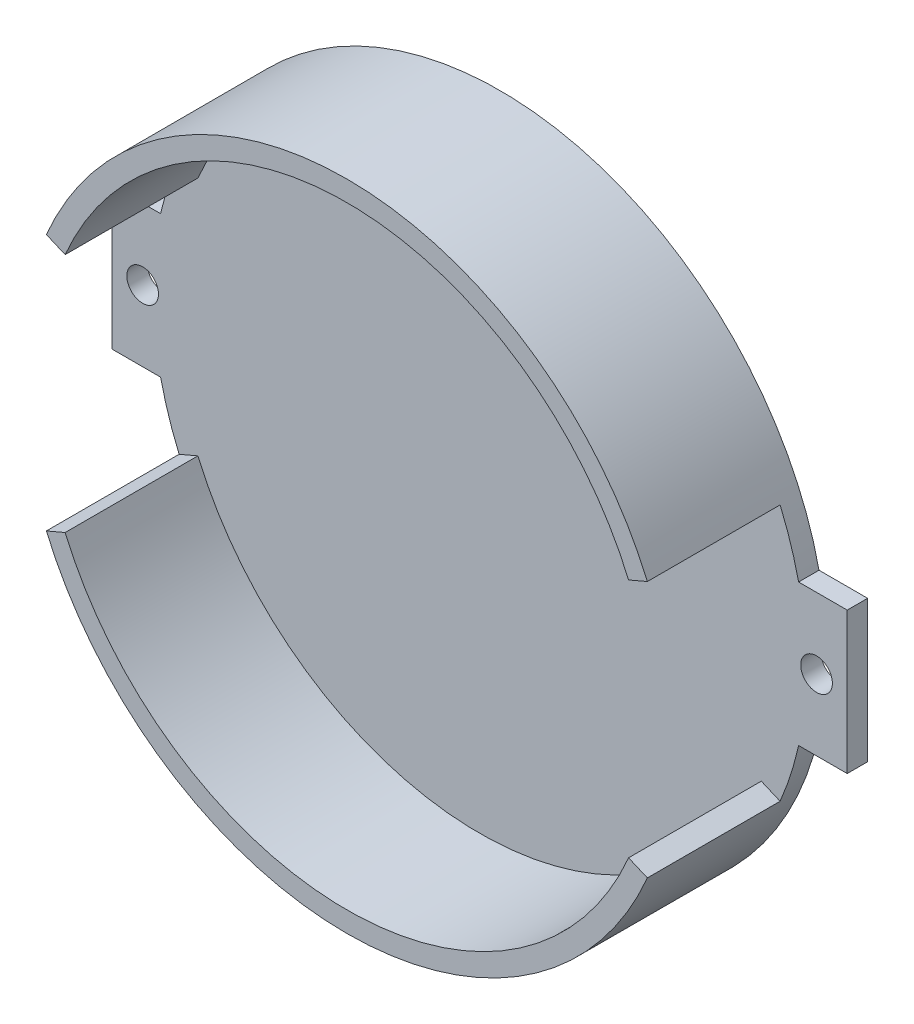
ISO-10303-21;
HEADER;
FILE_DESCRIPTION(('STEP AP214'),'2;1');
FILE_NAME('part.step','',(''),(''),'','','');
FILE_SCHEMA(('AUTOMOTIVE_DESIGN { 1 0 10303 214 1 1 1 1 }'));
ENDSEC;
DATA;
#1=APPLICATION_CONTEXT('core data for automotive mechanical design processes');
#2=APPLICATION_PROTOCOL_DEFINITION('international standard','automotive_design',2000,#1);
#3=PRODUCT_CONTEXT('',#1,'mechanical');
#4=PRODUCT('Part','Part','',(#3));
#5=PRODUCT_RELATED_PRODUCT_CATEGORY('part','',(#4));
#6=PRODUCT_DEFINITION_FORMATION('','',#4);
#7=PRODUCT_DEFINITION_CONTEXT('part definition',#1,'design');
#8=PRODUCT_DEFINITION('design','',#6,#7);
#9=PRODUCT_DEFINITION_SHAPE('','',#8);
#10=(LENGTH_UNIT() NAMED_UNIT(*) SI_UNIT(.MILLI.,.METRE.));
#11=(NAMED_UNIT(*) PLANE_ANGLE_UNIT() SI_UNIT($,.RADIAN.));
#12=(NAMED_UNIT(*) SI_UNIT($,.STERADIAN.) SOLID_ANGLE_UNIT());
#13=UNCERTAINTY_MEASURE_WITH_UNIT(LENGTH_MEASURE(1.E-05),#10,'distance_accuracy_value','');
#14=(GEOMETRIC_REPRESENTATION_CONTEXT(3) GLOBAL_UNCERTAINTY_ASSIGNED_CONTEXT((#13)) GLOBAL_UNIT_ASSIGNED_CONTEXT((#10,
#11,#12)) REPRESENTATION_CONTEXT('',''));
#15=CARTESIAN_POINT('',(0.,0.,0.));
#16=DIRECTION('',(0.,0.,1.));
#17=DIRECTION('',(1.,0.,0.));
#18=AXIS2_PLACEMENT_3D('',#15,#16,#17);
#19=CARTESIAN_POINT('',(0.,0.,2.));
#20=DIRECTION('',(0.,0.,1.));
#21=DIRECTION('',(1.,0.,0.));
#22=AXIS2_PLACEMENT_3D('',#19,#20,#21);
#23=PLANE('',#22);
#24=CARTESIAN_POINT('',(33.,0.,2.));
#25=DIRECTION('',(0.,0.,1.));
#26=DIRECTION('',(1.,0.,0.));
#27=AXIS2_PLACEMENT_3D('',#24,#25,#26);
#28=CIRCLE('',#27,1.55);
#29=CARTESIAN_POINT('',(34.55,0.,2.));
#30=VERTEX_POINT('',#29);
#31=EDGE_CURVE('E349',#30,#30,#28,.T.);
#32=ORIENTED_EDGE('',*,*,#31,.F.);
#33=EDGE_LOOP('',(#32));
#34=FACE_BOUND('',#33,.T.);
#35=CARTESIAN_POINT('',(-33.,0.,2.));
#36=DIRECTION('',(0.,0.,1.));
#37=DIRECTION('',(1.,0.,0.));
#38=AXIS2_PLACEMENT_3D('',#35,#36,#37);
#39=CIRCLE('',#38,1.55);
#40=CARTESIAN_POINT('',(-31.45,0.,2.));
#41=VERTEX_POINT('',#40);
#42=EDGE_CURVE('E356',#41,#41,#39,.T.);
#43=ORIENTED_EDGE('',*,*,#42,.F.);
#44=EDGE_LOOP('',(#43));
#45=FACE_BOUND('',#44,.T.);
#46=CARTESIAN_POINT('',(0.,0.,2.));
#47=DIRECTION('',(0.,0.,-1.));
#48=DIRECTION('',(1.,0.,0.));
#49=AXIS2_PLACEMENT_3D('',#46,#47,#48);
#50=CIRCLE('',#49,30.);
#51=CARTESIAN_POINT('',(27.5892817920815,-11.7826792452787,2.));
#52=VERTEX_POINT('',#51);
#53=CARTESIAN_POINT('',(-27.5892817920815,-11.7826792452786,2.));
#54=VERTEX_POINT('',#53);
#55=EDGE_CURVE('E345',#52,#54,#50,.T.);
#56=ORIENTED_EDGE('',*,*,#55,.F.);
#57=DIRECTION('',(-0.919642726402717,0.39275597484262,0.));
#58=VECTOR('',#57,1.);
#59=CARTESIAN_POINT('',(27.5892817920815,-11.7826792452787,2.));
#60=LINE('',#59,#58);
#61=CARTESIAN_POINT('',(29.4285672448869,-12.5681911949639,2.));
#62=VERTEX_POINT('',#61);
#63=EDGE_CURVE('E322',#62,#52,#60,.T.);
#64=ORIENTED_EDGE('',*,*,#63,.F.);
#65=CARTESIAN_POINT('',(0.,0.,2.));
#66=DIRECTION('',(0.,0.,1.));
#67=DIRECTION('',(1.,0.,0.));
#68=AXIS2_PLACEMENT_3D('',#65,#66,#67);
#69=CIRCLE('',#68,32.);
#70=CARTESIAN_POINT('',(31.2398605772959,-6.93333333333333,2.));
#71=VERTEX_POINT('',#70);
#72=EDGE_CURVE('E179',#62,#71,#69,.T.);
#73=ORIENTED_EDGE('',*,*,#72,.T.);
#74=DIRECTION('',(1.,0.,0.));
#75=VECTOR('',#74,1.);
#76=CARTESIAN_POINT('',(31.2398605772959,-6.93333333333333,2.));
#77=LINE('',#76,#75);
#78=CARTESIAN_POINT('',(36.,-6.93333333333333,2.));
#79=VERTEX_POINT('',#78);
#80=EDGE_CURVE('E240',#71,#79,#77,.T.);
#81=ORIENTED_EDGE('',*,*,#80,.T.);
#82=DIRECTION('',(0.,1.,0.));
#83=VECTOR('',#82,1.);
#84=CARTESIAN_POINT('',(36.,-6.93333333333333,2.));
#85=LINE('',#84,#83);
#86=CARTESIAN_POINT('',(36.,6.93333333333334,2.));
#87=VERTEX_POINT('',#86);
#88=EDGE_CURVE('E243',#79,#87,#85,.T.);
#89=ORIENTED_EDGE('',*,*,#88,.T.);
#90=DIRECTION('',(-1.,0.,0.));
#91=VECTOR('',#90,1.);
#92=CARTESIAN_POINT('',(36.,6.93333333333334,2.));
#93=LINE('',#92,#91);
#94=CARTESIAN_POINT('',(31.2398605772959,6.93333333333333,2.));
#95=VERTEX_POINT('',#94);
#96=EDGE_CURVE('E246',#87,#95,#93,.T.);
#97=ORIENTED_EDGE('',*,*,#96,.T.);
#98=CARTESIAN_POINT('',(0.,0.,2.));
#99=DIRECTION('',(0.,0.,1.));
#100=DIRECTION('',(1.,0.,0.));
#101=AXIS2_PLACEMENT_3D('',#98,#99,#100);
#102=CIRCLE('',#101,32.);
#103=CARTESIAN_POINT('',(29.4285672448869,12.5681911949639,2.));
#104=VERTEX_POINT('',#103);
#105=EDGE_CURVE('E250',#95,#104,#102,.T.);
#106=ORIENTED_EDGE('',*,*,#105,.T.);
#107=DIRECTION('',(0.919642726402717,0.392755974842622,0.));
#108=VECTOR('',#107,1.);
#109=CARTESIAN_POINT('',(29.4285672448869,12.5681911949639,2.));
#110=LINE('',#109,#108);
#111=CARTESIAN_POINT('',(27.5892817920815,11.7826792452787,2.));
#112=VERTEX_POINT('',#111);
#113=EDGE_CURVE('E63',#112,#104,#110,.T.);
#114=ORIENTED_EDGE('',*,*,#113,.F.);
#115=CARTESIAN_POINT('',(0.,0.,2.));
#116=DIRECTION('',(0.,0.,-1.));
#117=DIRECTION('',(1.,0.,0.));
#118=AXIS2_PLACEMENT_3D('',#115,#116,#117);
#119=CIRCLE('',#118,30.);
#120=CARTESIAN_POINT('',(-27.5892817920815,11.7826792452787,2.));
#121=VERTEX_POINT('',#120);
#122=EDGE_CURVE('E186',#121,#112,#119,.T.);
#123=ORIENTED_EDGE('',*,*,#122,.F.);
#124=DIRECTION('',(0.919642726402717,-0.392755974842622,0.));
#125=VECTOR('',#124,1.);
#126=CARTESIAN_POINT('',(-29.4285672448869,12.5681911949639,2.));
#127=LINE('',#126,#125);
#128=CARTESIAN_POINT('',(-29.4285672448869,12.5681911949639,2.));
#129=VERTEX_POINT('',#128);
#130=EDGE_CURVE('E181',#129,#121,#127,.T.);
#131=ORIENTED_EDGE('',*,*,#130,.F.);
#132=CARTESIAN_POINT('',(-31.2398605772959,6.93333333333333,2.));
#133=VERTEX_POINT('',#132);
#134=EDGE_CURVE('E249',#129,#133,#102,.T.);
#135=ORIENTED_EDGE('',*,*,#134,.T.);
#136=DIRECTION('',(-1.,0.,0.));
#137=VECTOR('',#136,1.);
#138=CARTESIAN_POINT('',(-36.,6.93333333333333,2.));
#139=LINE('',#138,#137);
#140=CARTESIAN_POINT('',(-36.,6.93333333333333,2.));
#141=VERTEX_POINT('',#140);
#142=EDGE_CURVE('E225',#133,#141,#139,.T.);
#143=ORIENTED_EDGE('',*,*,#142,.T.);
#144=DIRECTION('',(0.,-1.,0.));
#145=VECTOR('',#144,1.);
#146=CARTESIAN_POINT('',(-36.,-6.93333333333333,2.));
#147=LINE('',#146,#145);
#148=CARTESIAN_POINT('',(-36.,-6.93333333333333,2.));
#149=VERTEX_POINT('',#148);
#150=EDGE_CURVE('E229',#141,#149,#147,.T.);
#151=ORIENTED_EDGE('',*,*,#150,.T.);
#152=DIRECTION('',(1.,0.,0.));
#153=VECTOR('',#152,1.);
#154=CARTESIAN_POINT('',(-31.2398605772959,-6.93333333333333,2.));
#155=LINE('',#154,#153);
#156=CARTESIAN_POINT('',(-31.2398605772959,-6.93333333333333,2.));
#157=VERTEX_POINT('',#156);
#158=EDGE_CURVE('E233',#149,#157,#155,.T.);
#159=ORIENTED_EDGE('',*,*,#158,.T.);
#160=CARTESIAN_POINT('',(-29.4285672448869,-12.5681911949639,2.));
#161=VERTEX_POINT('',#160);
#162=EDGE_CURVE('E236',#157,#161,#69,.T.);
#163=ORIENTED_EDGE('',*,*,#162,.T.);
#164=DIRECTION('',(-0.919642726402717,-0.39275597484262,0.));
#165=VECTOR('',#164,1.);
#166=CARTESIAN_POINT('',(-27.5892817920815,-11.7826792452787,2.));
#167=LINE('',#166,#165);
#168=EDGE_CURVE('E174',#54,#161,#167,.T.);
#169=ORIENTED_EDGE('',*,*,#168,.F.);
#170=EDGE_LOOP('',(#56,#64,#73,#81,#89,#97,#106,#114,#123,#131,#135,#143,#151,#159,#163,#169));
#171=FACE_BOUND('',#170,.T.);
#172=ADVANCED_FACE('F39',(#34,#45,#171),#23,.T.);
#173=CARTESIAN_POINT('',(-36.,6.93333333333333,2.));
#174=DIRECTION('',(0.,-1.,0.));
#175=DIRECTION('',(0.,0.,-1.));
#176=AXIS2_PLACEMENT_3D('',#173,#174,#175);
#177=PLANE('',#176);
#178=DIRECTION('',(-1.,0.,0.));
#179=VECTOR('',#178,1.);
#180=CARTESIAN_POINT('',(-36.,6.93333333333333,0.));
#181=LINE('',#180,#179);
#182=CARTESIAN_POINT('',(-31.2398605772959,6.93333333333333,0.));
#183=VERTEX_POINT('',#182);
#184=CARTESIAN_POINT('',(-36.,6.93333333333333,0.));
#185=VERTEX_POINT('',#184);
#186=EDGE_CURVE('E224',#183,#185,#181,.T.);
#187=ORIENTED_EDGE('',*,*,#186,.T.);
#188=DIRECTION('',(0.,0.,-1.));
#189=VECTOR('',#188,1.);
#190=CARTESIAN_POINT('',(-36.,6.93333333333333,2.));
#191=LINE('',#190,#189);
#192=EDGE_CURVE('E11',#141,#185,#191,.T.);
#193=ORIENTED_EDGE('',*,*,#192,.F.);
#194=ORIENTED_EDGE('',*,*,#142,.F.);
#195=DIRECTION('',(0.,0.,-1.));
#196=VECTOR('',#195,1.);
#197=CARTESIAN_POINT('',(-31.2398605772959,6.93333333333333,2.));
#198=LINE('',#197,#196);
#199=EDGE_CURVE('E253',#133,#183,#198,.T.);
#200=ORIENTED_EDGE('',*,*,#199,.T.);
#201=EDGE_LOOP('',(#187,#193,#194,#200));
#202=FACE_BOUND('',#201,.T.);
#203=ADVANCED_FACE('F41',(#202),#177,.F.);
#204=CARTESIAN_POINT('',(-36.,-6.93333333333333,2.));
#205=DIRECTION('',(1.,0.,0.));
#206=DIRECTION('',(0.,0.,-1.));
#207=AXIS2_PLACEMENT_3D('',#204,#205,#206);
#208=PLANE('',#207);
#209=DIRECTION('',(0.,-1.,0.));
#210=VECTOR('',#209,1.);
#211=CARTESIAN_POINT('',(-36.,-6.93333333333333,0.));
#212=LINE('',#211,#210);
#213=CARTESIAN_POINT('',(-36.,-6.93333333333333,0.));
#214=VERTEX_POINT('',#213);
#215=EDGE_CURVE('E257',#185,#214,#212,.T.);
#216=ORIENTED_EDGE('',*,*,#215,.T.);
#217=DIRECTION('',(0.,0.,-1.));
#218=VECTOR('',#217,1.);
#219=CARTESIAN_POINT('',(-36.,-6.93333333333333,2.));
#220=LINE('',#219,#218);
#221=EDGE_CURVE('E48',#149,#214,#220,.T.);
#222=ORIENTED_EDGE('',*,*,#221,.F.);
#223=ORIENTED_EDGE('',*,*,#150,.F.);
#224=ORIENTED_EDGE('',*,*,#192,.T.);
#225=EDGE_LOOP('',(#216,#222,#223,#224));
#226=FACE_BOUND('',#225,.T.);
#227=ADVANCED_FACE('F334',(#226),#208,.F.);
#228=CARTESIAN_POINT('',(-31.2398605772959,-6.93333333333333,2.));
#229=DIRECTION('',(0.,1.,0.));
#230=DIRECTION('',(-1.,0.,0.));
#231=AXIS2_PLACEMENT_3D('',#228,#229,#230);
#232=PLANE('',#231);
#233=DIRECTION('',(1.,0.,0.));
#234=VECTOR('',#233,1.);
#235=CARTESIAN_POINT('',(-31.2398605772959,-6.93333333333333,0.));
#236=LINE('',#235,#234);
#237=CARTESIAN_POINT('',(-31.2398605772959,-6.93333333333333,0.));
#238=VERTEX_POINT('',#237);
#239=EDGE_CURVE('E260',#214,#238,#236,.T.);
#240=ORIENTED_EDGE('',*,*,#239,.T.);
#241=DIRECTION('',(0.,0.,-1.));
#242=VECTOR('',#241,1.);
#243=CARTESIAN_POINT('',(-31.2398605772959,-6.93333333333333,2.));
#244=LINE('',#243,#242);
#245=EDGE_CURVE('E296',#157,#238,#244,.T.);
#246=ORIENTED_EDGE('',*,*,#245,.F.);
#247=ORIENTED_EDGE('',*,*,#158,.F.);
#248=ORIENTED_EDGE('',*,*,#221,.T.);
#249=EDGE_LOOP('',(#240,#246,#247,#248));
#250=FACE_BOUND('',#249,.T.);
#251=ADVANCED_FACE('F305',(#250),#232,.F.);
#252=CARTESIAN_POINT('',(0.,0.,2.));
#253=DIRECTION('',(0.,0.,-1.));
#254=DIRECTION('',(-1.,0.,0.));
#255=AXIS2_PLACEMENT_3D('',#252,#253,#254);
#256=CYLINDRICAL_SURFACE('',#255,32.);
#257=CARTESIAN_POINT('',(0.,0.,0.));
#258=DIRECTION('',(0.,0.,1.));
#259=DIRECTION('',(1.,0.,0.));
#260=AXIS2_PLACEMENT_3D('',#257,#258,#259);
#261=CIRCLE('',#260,32.);
#262=CARTESIAN_POINT('',(31.2398605772959,-6.93333333333333,0.));
#263=VERTEX_POINT('',#262);
#264=EDGE_CURVE('E263',#238,#263,#261,.T.);
#265=ORIENTED_EDGE('',*,*,#264,.T.);
#266=DIRECTION('',(0.,0.,-1.));
#267=VECTOR('',#266,1.);
#268=CARTESIAN_POINT('',(31.2398605772959,-6.93333333333333,2.));
#269=LINE('',#268,#267);
#270=EDGE_CURVE('E292',#71,#263,#269,.T.);
#271=ORIENTED_EDGE('',*,*,#270,.F.);
#272=ORIENTED_EDGE('',*,*,#72,.F.);
#273=DIRECTION('',(0.,0.,-1.));
#274=VECTOR('',#273,1.);
#275=CARTESIAN_POINT('',(29.4285672448869,-12.5681911949639,15.));
#276=LINE('',#275,#274);
#277=CARTESIAN_POINT('',(29.4285672448869,-12.5681911949639,15.));
#278=VERTEX_POINT('',#277);
#279=EDGE_CURVE('E157',#278,#62,#276,.T.);
#280=ORIENTED_EDGE('',*,*,#279,.F.);
#281=CARTESIAN_POINT('',(0.,0.,15.));
#282=DIRECTION('',(0.,0.,1.));
#283=DIRECTION('',(1.,0.,0.));
#284=AXIS2_PLACEMENT_3D('',#281,#282,#283);
#285=CIRCLE('',#284,32.);
#286=CARTESIAN_POINT('',(-29.4285672448869,-12.5681911949639,15.));
#287=VERTEX_POINT('',#286);
#288=EDGE_CURVE('E165',#287,#278,#285,.T.);
#289=ORIENTED_EDGE('',*,*,#288,.F.);
#290=DIRECTION('',(0.,0.,-1.));
#291=VECTOR('',#290,1.);
#292=CARTESIAN_POINT('',(-29.4285672448869,-12.5681911949639,15.));
#293=LINE('',#292,#291);
#294=EDGE_CURVE('E336',#287,#161,#293,.T.);
#295=ORIENTED_EDGE('',*,*,#294,.T.);
#296=ORIENTED_EDGE('',*,*,#162,.F.);
#297=ORIENTED_EDGE('',*,*,#245,.T.);
#298=EDGE_LOOP('',(#265,#271,#272,#280,#289,#295,#296,#297));
#299=FACE_BOUND('',#298,.T.);
#300=ADVANCED_FACE('F177',(#299),#256,.T.);
#301=CARTESIAN_POINT('',(31.2398605772959,-6.93333333333333,2.));
#302=DIRECTION('',(0.,1.,0.));
#303=DIRECTION('',(-1.,0.,0.));
#304=AXIS2_PLACEMENT_3D('',#301,#302,#303);
#305=PLANE('',#304);
#306=DIRECTION('',(1.,0.,0.));
#307=VECTOR('',#306,1.);
#308=CARTESIAN_POINT('',(31.2398605772959,-6.93333333333333,0.));
#309=LINE('',#308,#307);
#310=CARTESIAN_POINT('',(36.,-6.93333333333333,0.));
#311=VERTEX_POINT('',#310);
#312=EDGE_CURVE('E266',#263,#311,#309,.T.);
#313=ORIENTED_EDGE('',*,*,#312,.T.);
#314=DIRECTION('',(0.,0.,-1.));
#315=VECTOR('',#314,1.);
#316=CARTESIAN_POINT('',(36.,-6.93333333333333,2.));
#317=LINE('',#316,#315);
#318=EDGE_CURVE('E288',#79,#311,#317,.T.);
#319=ORIENTED_EDGE('',*,*,#318,.F.);
#320=ORIENTED_EDGE('',*,*,#80,.F.);
#321=ORIENTED_EDGE('',*,*,#270,.T.);
#322=EDGE_LOOP('',(#313,#319,#320,#321));
#323=FACE_BOUND('',#322,.T.);
#324=ADVANCED_FACE('F317',(#323),#305,.F.);
#325=CARTESIAN_POINT('',(36.,-6.93333333333333,2.));
#326=DIRECTION('',(-1.,0.,0.));
#327=DIRECTION('',(0.,-1.,0.));
#328=AXIS2_PLACEMENT_3D('',#325,#326,#327);
#329=PLANE('',#328);
#330=DIRECTION('',(0.,1.,0.));
#331=VECTOR('',#330,1.);
#332=CARTESIAN_POINT('',(36.,-6.93333333333333,0.));
#333=LINE('',#332,#331);
#334=CARTESIAN_POINT('',(36.,6.93333333333334,0.));
#335=VERTEX_POINT('',#334);
#336=EDGE_CURVE('E269',#311,#335,#333,.T.);
#337=ORIENTED_EDGE('',*,*,#336,.T.);
#338=DIRECTION('',(0.,0.,-1.));
#339=VECTOR('',#338,1.);
#340=CARTESIAN_POINT('',(36.,6.93333333333334,2.));
#341=LINE('',#340,#339);
#342=EDGE_CURVE('E284',#87,#335,#341,.T.);
#343=ORIENTED_EDGE('',*,*,#342,.F.);
#344=ORIENTED_EDGE('',*,*,#88,.F.);
#345=ORIENTED_EDGE('',*,*,#318,.T.);
#346=EDGE_LOOP('',(#337,#343,#344,#345));
#347=FACE_BOUND('',#346,.T.);
#348=ADVANCED_FACE('F405',(#347),#329,.F.);
#349=CARTESIAN_POINT('',(36.,6.93333333333334,2.));
#350=DIRECTION('',(0.,-1.,0.));
#351=DIRECTION('',(1.,0.,0.));
#352=AXIS2_PLACEMENT_3D('',#349,#350,#351);
#353=PLANE('',#352);
#354=DIRECTION('',(-1.,0.,0.));
#355=VECTOR('',#354,1.);
#356=CARTESIAN_POINT('',(36.,6.93333333333334,0.));
#357=LINE('',#356,#355);
#358=CARTESIAN_POINT('',(31.2398605772959,6.93333333333333,0.));
#359=VERTEX_POINT('',#358);
#360=EDGE_CURVE('E272',#335,#359,#357,.T.);
#361=ORIENTED_EDGE('',*,*,#360,.T.);
#362=DIRECTION('',(0.,0.,-1.));
#363=VECTOR('',#362,1.);
#364=CARTESIAN_POINT('',(31.2398605772959,6.93333333333333,2.));
#365=LINE('',#364,#363);
#366=EDGE_CURVE('E280',#95,#359,#365,.T.);
#367=ORIENTED_EDGE('',*,*,#366,.F.);
#368=ORIENTED_EDGE('',*,*,#96,.F.);
#369=ORIENTED_EDGE('',*,*,#342,.T.);
#370=EDGE_LOOP('',(#361,#367,#368,#369));
#371=FACE_BOUND('',#370,.T.);
#372=ADVANCED_FACE('F402',(#371),#353,.F.);
#373=CARTESIAN_POINT('',(0.,0.,2.));
#374=DIRECTION('',(0.,0.,-1.));
#375=DIRECTION('',(-1.,0.,0.));
#376=AXIS2_PLACEMENT_3D('',#373,#374,#375);
#377=CYLINDRICAL_SURFACE('',#376,32.);
#378=CARTESIAN_POINT('',(0.,0.,0.));
#379=DIRECTION('',(0.,0.,1.));
#380=DIRECTION('',(1.,0.,0.));
#381=AXIS2_PLACEMENT_3D('',#378,#379,#380);
#382=CIRCLE('',#381,32.);
#383=EDGE_CURVE('E230',#359,#183,#382,.T.);
#384=ORIENTED_EDGE('',*,*,#383,.T.);
#385=ORIENTED_EDGE('',*,*,#199,.F.);
#386=ORIENTED_EDGE('',*,*,#134,.F.);
#387=DIRECTION('',(0.,0.,-1.));
#388=VECTOR('',#387,1.);
#389=CARTESIAN_POINT('',(-29.4285672448869,12.5681911949639,15.));
#390=LINE('',#389,#388);
#391=CARTESIAN_POINT('',(-29.4285672448869,12.5681911949639,15.));
#392=VERTEX_POINT('',#391);
#393=EDGE_CURVE('E220',#392,#129,#390,.T.);
#394=ORIENTED_EDGE('',*,*,#393,.F.);
#395=CARTESIAN_POINT('',(0.,0.,15.));
#396=DIRECTION('',(0.,0.,1.));
#397=DIRECTION('',(1.,0.,0.));
#398=AXIS2_PLACEMENT_3D('',#395,#396,#397);
#399=CIRCLE('',#398,32.);
#400=CARTESIAN_POINT('',(29.4285672448869,12.5681911949639,15.));
#401=VERTEX_POINT('',#400);
#402=EDGE_CURVE('E191',#401,#392,#399,.T.);
#403=ORIENTED_EDGE('',*,*,#402,.F.);
#404=DIRECTION('',(0.,0.,-1.));
#405=VECTOR('',#404,1.);
#406=CARTESIAN_POINT('',(29.4285672448869,12.5681911949639,15.));
#407=LINE('',#406,#405);
#408=EDGE_CURVE('E203',#401,#104,#407,.T.);
#409=ORIENTED_EDGE('',*,*,#408,.T.);
#410=ORIENTED_EDGE('',*,*,#105,.F.);
#411=ORIENTED_EDGE('',*,*,#366,.T.);
#412=EDGE_LOOP('',(#384,#385,#386,#394,#403,#409,#410,#411));
#413=FACE_BOUND('',#412,.T.);
#414=ADVANCED_FACE('F331',(#413),#377,.T.);
#415=CARTESIAN_POINT('',(0.,0.,0.));
#416=DIRECTION('',(0.,0.,1.));
#417=DIRECTION('',(1.,0.,0.));
#418=AXIS2_PLACEMENT_3D('',#415,#416,#417);
#419=PLANE('',#418);
#420=CARTESIAN_POINT('',(33.,0.,0.));
#421=DIRECTION('',(0.,0.,-1.));
#422=DIRECTION('',(-1.,0.,0.));
#423=AXIS2_PLACEMENT_3D('',#420,#421,#422);
#424=CIRCLE('',#423,1.55);
#425=CARTESIAN_POINT('',(31.45,0.,0.));
#426=VERTEX_POINT('',#425);
#427=EDGE_CURVE('E360',#426,#426,#424,.T.);
#428=ORIENTED_EDGE('',*,*,#427,.F.);
#429=EDGE_LOOP('',(#428));
#430=FACE_BOUND('',#429,.T.);
#431=CARTESIAN_POINT('',(-33.,0.,0.));
#432=DIRECTION('',(0.,0.,-1.));
#433=DIRECTION('',(-1.,0.,0.));
#434=AXIS2_PLACEMENT_3D('',#431,#432,#433);
#435=CIRCLE('',#434,1.55);
#436=CARTESIAN_POINT('',(-34.55,0.,0.));
#437=VERTEX_POINT('',#436);
#438=EDGE_CURVE('E361',#437,#437,#435,.T.);
#439=ORIENTED_EDGE('',*,*,#438,.F.);
#440=EDGE_LOOP('',(#439));
#441=FACE_BOUND('',#440,.T.);
#442=ORIENTED_EDGE('',*,*,#186,.F.);
#443=ORIENTED_EDGE('',*,*,#383,.F.);
#444=ORIENTED_EDGE('',*,*,#360,.F.);
#445=ORIENTED_EDGE('',*,*,#336,.F.);
#446=ORIENTED_EDGE('',*,*,#312,.F.);
#447=ORIENTED_EDGE('',*,*,#264,.F.);
#448=ORIENTED_EDGE('',*,*,#239,.F.);
#449=ORIENTED_EDGE('',*,*,#215,.F.);
#450=EDGE_LOOP('',(#442,#443,#444,#445,#446,#447,#448,#449));
#451=FACE_BOUND('',#450,.T.);
#452=ADVANCED_FACE('F311',(#430,#441,#451),#419,.F.);
#453=CARTESIAN_POINT('',(-29.4285672448869,12.5681911949639,15.));
#454=DIRECTION('',(0.392755974842622,0.919642726402716,0.));
#455=DIRECTION('',(-0.919642726402717,0.392755974842622,0.));
#456=AXIS2_PLACEMENT_3D('',#453,#454,#455);
#457=PLANE('',#456);
#458=ORIENTED_EDGE('',*,*,#130,.T.);
#459=DIRECTION('',(0.,0.,-1.));
#460=VECTOR('',#459,1.);
#461=CARTESIAN_POINT('',(-27.5892817920815,11.7826792452787,15.));
#462=LINE('',#461,#460);
#463=CARTESIAN_POINT('',(-27.5892817920815,11.7826792452787,15.));
#464=VERTEX_POINT('',#463);
#465=EDGE_CURVE('E216',#464,#121,#462,.T.);
#466=ORIENTED_EDGE('',*,*,#465,.F.);
#467=DIRECTION('',(0.919642726402717,-0.392755974842622,0.));
#468=VECTOR('',#467,1.);
#469=CARTESIAN_POINT('',(-29.4285672448869,12.5681911949639,15.));
#470=LINE('',#469,#468);
#471=EDGE_CURVE('E195',#392,#464,#470,.T.);
#472=ORIENTED_EDGE('',*,*,#471,.F.);
#473=ORIENTED_EDGE('',*,*,#393,.T.);
#474=EDGE_LOOP('',(#458,#466,#472,#473));
#475=FACE_BOUND('',#474,.T.);
#476=ADVANCED_FACE('F373',(#475),#457,.F.);
#477=CARTESIAN_POINT('',(0.,0.,15.));
#478=DIRECTION('',(0.,0.,-1.));
#479=DIRECTION('',(-1.,0.,0.));
#480=AXIS2_PLACEMENT_3D('',#477,#478,#479);
#481=CYLINDRICAL_SURFACE('',#480,30.);
#482=ORIENTED_EDGE('',*,*,#122,.T.);
#483=DIRECTION('',(0.,0.,-1.));
#484=VECTOR('',#483,1.);
#485=CARTESIAN_POINT('',(27.5892817920815,11.7826792452787,15.));
#486=LINE('',#485,#484);
#487=CARTESIAN_POINT('',(27.5892817920815,11.7826792452787,15.));
#488=VERTEX_POINT('',#487);
#489=EDGE_CURVE('E212',#488,#112,#486,.T.);
#490=ORIENTED_EDGE('',*,*,#489,.F.);
#491=CARTESIAN_POINT('',(0.,0.,15.));
#492=DIRECTION('',(0.,0.,-1.));
#493=DIRECTION('',(1.,0.,0.));
#494=AXIS2_PLACEMENT_3D('',#491,#492,#493);
#495=CIRCLE('',#494,30.);
#496=EDGE_CURVE('E198',#464,#488,#495,.T.);
#497=ORIENTED_EDGE('',*,*,#496,.F.);
#498=ORIENTED_EDGE('',*,*,#465,.T.);
#499=EDGE_LOOP('',(#482,#490,#497,#498));
#500=FACE_BOUND('',#499,.T.);
#501=ADVANCED_FACE('F454',(#500),#481,.F.);
#502=CARTESIAN_POINT('',(29.4285672448869,12.5681911949639,15.));
#503=DIRECTION('',(-0.392755974842622,0.919642726402716,0.));
#504=DIRECTION('',(-0.919642726402717,-0.392755974842622,0.));
#505=AXIS2_PLACEMENT_3D('',#502,#503,#504);
#506=PLANE('',#505);
#507=ORIENTED_EDGE('',*,*,#113,.T.);
#508=ORIENTED_EDGE('',*,*,#408,.F.);
#509=DIRECTION('',(0.919642726402717,0.392755974842622,0.));
#510=VECTOR('',#509,1.);
#511=CARTESIAN_POINT('',(29.4285672448869,12.5681911949639,15.));
#512=LINE('',#511,#510);
#513=EDGE_CURVE('E201',#488,#401,#512,.T.);
#514=ORIENTED_EDGE('',*,*,#513,.F.);
#515=ORIENTED_EDGE('',*,*,#489,.T.);
#516=EDGE_LOOP('',(#507,#508,#514,#515));
#517=FACE_BOUND('',#516,.T.);
#518=ADVANCED_FACE('F461',(#517),#506,.F.);
#519=CARTESIAN_POINT('',(0.,0.,15.));
#520=DIRECTION('',(0.,0.,1.));
#521=DIRECTION('',(1.,0.,0.));
#522=AXIS2_PLACEMENT_3D('',#519,#520,#521);
#523=PLANE('',#522);
#524=ORIENTED_EDGE('',*,*,#402,.T.);
#525=ORIENTED_EDGE('',*,*,#471,.T.);
#526=ORIENTED_EDGE('',*,*,#496,.T.);
#527=ORIENTED_EDGE('',*,*,#513,.T.);
#528=EDGE_LOOP('',(#524,#525,#526,#527));
#529=FACE_BOUND('',#528,.T.);
#530=ADVANCED_FACE('F468',(#529),#523,.T.);
#531=CARTESIAN_POINT('',(27.5892817920815,-11.7826792452787,15.));
#532=DIRECTION('',(-0.392755974842621,-0.919642726402717,0.));
#533=DIRECTION('',(0.919642726402717,-0.392755974842621,0.));
#534=AXIS2_PLACEMENT_3D('',#531,#532,#533);
#535=PLANE('',#534);
#536=ORIENTED_EDGE('',*,*,#63,.T.);
#537=DIRECTION('',(0.,0.,-1.));
#538=VECTOR('',#537,1.);
#539=CARTESIAN_POINT('',(27.5892817920815,-11.7826792452787,15.));
#540=LINE('',#539,#538);
#541=CARTESIAN_POINT('',(27.5892817920815,-11.7826792452787,15.));
#542=VERTEX_POINT('',#541);
#543=EDGE_CURVE('E160',#542,#52,#540,.T.);
#544=ORIENTED_EDGE('',*,*,#543,.F.);
#545=DIRECTION('',(-0.919642726402717,0.39275597484262,0.));
#546=VECTOR('',#545,1.);
#547=CARTESIAN_POINT('',(27.5892817920815,-11.7826792452787,15.));
#548=LINE('',#547,#546);
#549=EDGE_CURVE('E153',#278,#542,#548,.T.);
#550=ORIENTED_EDGE('',*,*,#549,.F.);
#551=ORIENTED_EDGE('',*,*,#279,.T.);
#552=EDGE_LOOP('',(#536,#544,#550,#551));
#553=FACE_BOUND('',#552,.T.);
#554=ADVANCED_FACE('F155',(#553),#535,.F.);
#555=CARTESIAN_POINT('',(0.,0.,15.));
#556=DIRECTION('',(0.,0.,-1.));
#557=DIRECTION('',(-1.,0.,0.));
#558=AXIS2_PLACEMENT_3D('',#555,#556,#557);
#559=CYLINDRICAL_SURFACE('',#558,30.);
#560=ORIENTED_EDGE('',*,*,#55,.T.);
#561=DIRECTION('',(0.,0.,-1.));
#562=VECTOR('',#561,1.);
#563=CARTESIAN_POINT('',(-27.5892817920815,-11.7826792452787,15.));
#564=LINE('',#563,#562);
#565=CARTESIAN_POINT('',(-27.5892817920815,-11.7826792452787,15.));
#566=VERTEX_POINT('',#565);
#567=EDGE_CURVE('E55',#566,#54,#564,.T.);
#568=ORIENTED_EDGE('',*,*,#567,.F.);
#569=CARTESIAN_POINT('',(0.,0.,15.));
#570=DIRECTION('',(0.,0.,-1.));
#571=DIRECTION('',(1.,0.,0.));
#572=AXIS2_PLACEMENT_3D('',#569,#570,#571);
#573=CIRCLE('',#572,30.);
#574=EDGE_CURVE('E164',#542,#566,#573,.T.);
#575=ORIENTED_EDGE('',*,*,#574,.F.);
#576=ORIENTED_EDGE('',*,*,#543,.T.);
#577=EDGE_LOOP('',(#560,#568,#575,#576));
#578=FACE_BOUND('',#577,.T.);
#579=ADVANCED_FACE('F483',(#578),#559,.F.);
#580=CARTESIAN_POINT('',(-27.5892817920815,-11.7826792452787,15.));
#581=DIRECTION('',(0.392755974842621,-0.919642726402717,0.));
#582=DIRECTION('',(0.919642726402717,0.392755974842621,0.));
#583=AXIS2_PLACEMENT_3D('',#580,#581,#582);
#584=PLANE('',#583);
#585=ORIENTED_EDGE('',*,*,#168,.T.);
#586=ORIENTED_EDGE('',*,*,#294,.F.);
#587=DIRECTION('',(-0.919642726402717,-0.39275597484262,0.));
#588=VECTOR('',#587,1.);
#589=CARTESIAN_POINT('',(-27.5892817920815,-11.7826792452787,15.));
#590=LINE('',#589,#588);
#591=EDGE_CURVE('E169',#566,#287,#590,.T.);
#592=ORIENTED_EDGE('',*,*,#591,.F.);
#593=ORIENTED_EDGE('',*,*,#567,.T.);
#594=EDGE_LOOP('',(#585,#586,#592,#593));
#595=FACE_BOUND('',#594,.T.);
#596=ADVANCED_FACE('F387',(#595),#584,.F.);
#597=CARTESIAN_POINT('',(0.,0.,15.));
#598=DIRECTION('',(0.,0.,1.));
#599=DIRECTION('',(1.,0.,0.));
#600=AXIS2_PLACEMENT_3D('',#597,#598,#599);
#601=PLANE('',#600);
#602=ORIENTED_EDGE('',*,*,#288,.T.);
#603=ORIENTED_EDGE('',*,*,#549,.T.);
#604=ORIENTED_EDGE('',*,*,#574,.T.);
#605=ORIENTED_EDGE('',*,*,#591,.T.);
#606=EDGE_LOOP('',(#602,#603,#604,#605));
#607=FACE_BOUND('',#606,.T.);
#608=ADVANCED_FACE('F168',(#607),#601,.T.);
#609=CARTESIAN_POINT('',(-33.,0.,15.));
#610=DIRECTION('',(0.,0.,-1.));
#611=DIRECTION('',(-1.,0.,0.));
#612=AXIS2_PLACEMENT_3D('',#609,#610,#611);
#613=CYLINDRICAL_SURFACE('',#612,1.55);
#614=ORIENTED_EDGE('',*,*,#42,.T.);
#615=EDGE_LOOP('',(#614));
#616=FACE_BOUND('',#615,.T.);
#617=ORIENTED_EDGE('',*,*,#438,.T.);
#618=EDGE_LOOP('',(#617));
#619=FACE_BOUND('',#618,.T.);
#620=ADVANCED_FACE('F377',(#616,#619),#613,.F.);
#621=CARTESIAN_POINT('',(33.,0.,15.));
#622=DIRECTION('',(0.,0.,-1.));
#623=DIRECTION('',(-1.,0.,0.));
#624=AXIS2_PLACEMENT_3D('',#621,#622,#623);
#625=CYLINDRICAL_SURFACE('',#624,1.55);
#626=ORIENTED_EDGE('',*,*,#31,.T.);
#627=EDGE_LOOP('',(#626));
#628=FACE_BOUND('',#627,.T.);
#629=ORIENTED_EDGE('',*,*,#427,.T.);
#630=EDGE_LOOP('',(#629));
#631=FACE_BOUND('',#630,.T.);
#632=ADVANCED_FACE('F369',(#628,#631),#625,.F.);
#633=CLOSED_SHELL('',(#172,#203,#227,#251,#300,#324,#348,#372,#414,#452,#476,#501,#518,#530,
#554,#579,#596,#608,#620,#632));
#634=MANIFOLD_SOLID_BREP('B2',#633);
#635=ADVANCED_BREP_SHAPE_REPRESENTATION('',(#18,#634),#14);
#636=SHAPE_DEFINITION_REPRESENTATION(#9,#635);
ENDSEC;
END-ISO-10303-21;
